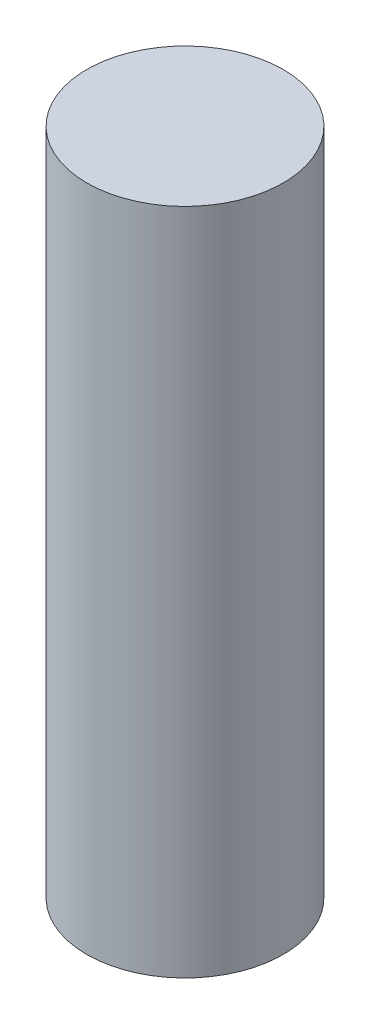
ISO-10303-21;
HEADER;
FILE_DESCRIPTION(('STEP AP214'),'2;1');
FILE_NAME('part.step','',(''),(''),'','','');
FILE_SCHEMA(('AUTOMOTIVE_DESIGN { 1 0 10303 214 1 1 1 1 }'));
ENDSEC;
DATA;
#1=APPLICATION_CONTEXT('core data for automotive mechanical design processes');
#2=APPLICATION_PROTOCOL_DEFINITION('international standard','automotive_design',2000,#1);
#3=PRODUCT_CONTEXT('',#1,'mechanical');
#4=PRODUCT('Part','Part','',(#3));
#5=PRODUCT_RELATED_PRODUCT_CATEGORY('part','',(#4));
#6=PRODUCT_DEFINITION_FORMATION('','',#4);
#7=PRODUCT_DEFINITION_CONTEXT('part definition',#1,'design');
#8=PRODUCT_DEFINITION('design','',#6,#7);
#9=PRODUCT_DEFINITION_SHAPE('','',#8);
#10=(LENGTH_UNIT() NAMED_UNIT(*) SI_UNIT(.MILLI.,.METRE.));
#11=(NAMED_UNIT(*) PLANE_ANGLE_UNIT() SI_UNIT($,.RADIAN.));
#12=(NAMED_UNIT(*) SI_UNIT($,.STERADIAN.) SOLID_ANGLE_UNIT());
#13=UNCERTAINTY_MEASURE_WITH_UNIT(LENGTH_MEASURE(1.E-05),#10,'distance_accuracy_value','');
#14=(GEOMETRIC_REPRESENTATION_CONTEXT(3) GLOBAL_UNCERTAINTY_ASSIGNED_CONTEXT((#13)) GLOBAL_UNIT_ASSIGNED_CONTEXT((#10,
#11,#12)) REPRESENTATION_CONTEXT('',''));
#15=CARTESIAN_POINT('',(0.,0.,0.));
#16=DIRECTION('',(0.,0.,1.));
#17=DIRECTION('',(1.,0.,0.));
#18=AXIS2_PLACEMENT_3D('',#15,#16,#17);
#19=CARTESIAN_POINT('',(0.,34.,0.));
#20=DIRECTION('',(0.,-1.,0.));
#21=DIRECTION('',(0.,0.,-1.));
#22=AXIS2_PLACEMENT_3D('',#19,#20,#21);
#23=CYLINDRICAL_SURFACE('',#22,5.);
#24=CARTESIAN_POINT('',(0.,34.,0.));
#25=DIRECTION('',(0.,1.,0.));
#26=DIRECTION('',(0.,0.,1.));
#27=AXIS2_PLACEMENT_3D('',#24,#25,#26);
#28=CIRCLE('',#27,5.);
#29=CARTESIAN_POINT('',(0.,34.,5.));
#30=VERTEX_POINT('',#29);
#31=EDGE_CURVE('E10',#30,#30,#28,.T.);
#32=ORIENTED_EDGE('',*,*,#31,.F.);
#33=EDGE_LOOP('',(#32));
#34=FACE_BOUND('',#33,.T.);
#35=CARTESIAN_POINT('',(0.,0.,0.));
#36=DIRECTION('',(0.,1.,0.));
#37=DIRECTION('',(0.,0.,1.));
#38=AXIS2_PLACEMENT_3D('',#35,#36,#37);
#39=CIRCLE('',#38,5.);
#40=CARTESIAN_POINT('',(0.,0.,5.));
#41=VERTEX_POINT('',#40);
#42=EDGE_CURVE('E34',#41,#41,#39,.T.);
#43=ORIENTED_EDGE('',*,*,#42,.T.);
#44=EDGE_LOOP('',(#43));
#45=FACE_BOUND('',#44,.T.);
#46=ADVANCED_FACE('F31',(#34,#45),#23,.T.);
#47=CARTESIAN_POINT('',(0.,34.,0.));
#48=DIRECTION('',(0.,1.,0.));
#49=DIRECTION('',(0.,0.,1.));
#50=AXIS2_PLACEMENT_3D('',#47,#48,#49);
#51=PLANE('',#50);
#52=ORIENTED_EDGE('',*,*,#31,.T.);
#53=EDGE_LOOP('',(#52));
#54=FACE_BOUND('',#53,.T.);
#55=ADVANCED_FACE('F46',(#54),#51,.T.);
#56=CARTESIAN_POINT('',(0.,0.,0.));
#57=DIRECTION('',(0.,1.,0.));
#58=DIRECTION('',(0.,0.,1.));
#59=AXIS2_PLACEMENT_3D('',#56,#57,#58);
#60=PLANE('',#59);
#61=ORIENTED_EDGE('',*,*,#42,.F.);
#62=EDGE_LOOP('',(#61));
#63=FACE_BOUND('',#62,.T.);
#64=ADVANCED_FACE('F44',(#63),#60,.F.);
#65=CLOSED_SHELL('',(#46,#55,#64));
#66=MANIFOLD_SOLID_BREP('B2',#65);
#67=ADVANCED_BREP_SHAPE_REPRESENTATION('',(#18,#66),#14);
#68=SHAPE_DEFINITION_REPRESENTATION(#9,#67);
ENDSEC;
END-ISO-10303-21;
